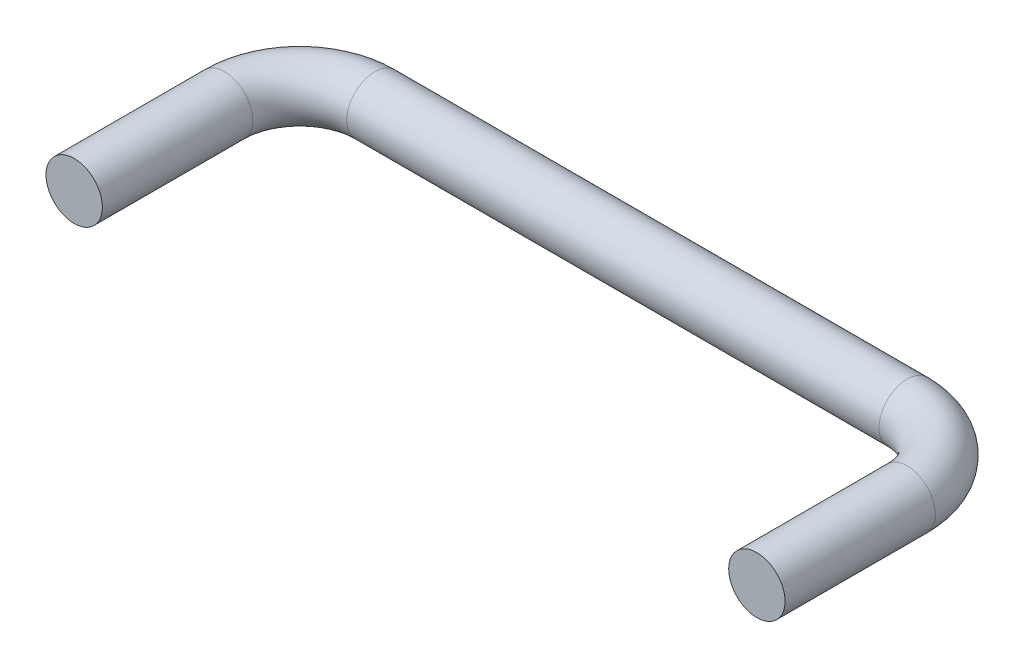
ISO-10303-21;
HEADER;
FILE_DESCRIPTION(('STEP AP214'),'2;1');
FILE_NAME('part.step','',(''),(''),'','','');
FILE_SCHEMA(('AUTOMOTIVE_DESIGN { 1 0 10303 214 1 1 1 1 }'));
ENDSEC;
DATA;
#1=APPLICATION_CONTEXT('core data for automotive mechanical design processes');
#2=APPLICATION_PROTOCOL_DEFINITION('international standard','automotive_design',2000,#1);
#3=PRODUCT_CONTEXT('',#1,'mechanical');
#4=PRODUCT('Part','Part','',(#3));
#5=PRODUCT_RELATED_PRODUCT_CATEGORY('part','',(#4));
#6=PRODUCT_DEFINITION_FORMATION('','',#4);
#7=PRODUCT_DEFINITION_CONTEXT('part definition',#1,'design');
#8=PRODUCT_DEFINITION('design','',#6,#7);
#9=PRODUCT_DEFINITION_SHAPE('','',#8);
#10=(LENGTH_UNIT() NAMED_UNIT(*) SI_UNIT(.MILLI.,.METRE.));
#11=(NAMED_UNIT(*) PLANE_ANGLE_UNIT() SI_UNIT($,.RADIAN.));
#12=(NAMED_UNIT(*) SI_UNIT($,.STERADIAN.) SOLID_ANGLE_UNIT());
#13=UNCERTAINTY_MEASURE_WITH_UNIT(LENGTH_MEASURE(1.E-05),#10,'distance_accuracy_value','');
#14=(GEOMETRIC_REPRESENTATION_CONTEXT(3) GLOBAL_UNCERTAINTY_ASSIGNED_CONTEXT((#13)) GLOBAL_UNIT_ASSIGNED_CONTEXT((#10,
#11,#12)) REPRESENTATION_CONTEXT('',''));
#15=CARTESIAN_POINT('',(0.,0.,0.));
#16=DIRECTION('',(0.,0.,1.));
#17=DIRECTION('',(1.,0.,0.));
#18=AXIS2_PLACEMENT_3D('',#15,#16,#17);
#19=CARTESIAN_POINT('',(0.,0.,0.));
#20=DIRECTION('',(0.,0.,1.));
#21=DIRECTION('',(1.,0.,0.));
#22=AXIS2_PLACEMENT_3D('',#19,#20,#21);
#23=PLANE('',#22);
#24=CARTESIAN_POINT('',(0.,0.,0.));
#25=DIRECTION('',(0.,0.,1.));
#26=DIRECTION('',(1.,0.,0.));
#27=AXIS2_PLACEMENT_3D('',#24,#25,#26);
#28=CIRCLE('',#27,3.75);
#29=CARTESIAN_POINT('',(3.75,0.,0.));
#30=VERTEX_POINT('',#29);
#31=EDGE_CURVE('E58',#30,#30,#28,.T.);
#32=ORIENTED_EDGE('',*,*,#31,.T.);
#33=EDGE_LOOP('',(#32));
#34=FACE_BOUND('',#33,.T.);
#35=ADVANCED_FACE('F36',(#34),#23,.T.);
#36=CARTESIAN_POINT('',(90.824,0.,0.));
#37=DIRECTION('',(0.,0.,-1.));
#38=DIRECTION('',(-1.,0.,0.));
#39=AXIS2_PLACEMENT_3D('',#36,#37,#38);
#40=PLANE('',#39);
#41=CARTESIAN_POINT('',(90.824,0.,0.));
#42=DIRECTION('',(0.,0.,-1.));
#43=DIRECTION('',(-1.,0.,0.));
#44=AXIS2_PLACEMENT_3D('',#41,#42,#43);
#45=CIRCLE('',#44,3.75);
#46=CARTESIAN_POINT('',(87.074,0.,0.));
#47=VERTEX_POINT('',#46);
#48=EDGE_CURVE('E10',#47,#47,#45,.T.);
#49=ORIENTED_EDGE('',*,*,#48,.F.);
#50=EDGE_LOOP('',(#49));
#51=FACE_BOUND('',#50,.T.);
#52=ADVANCED_FACE('F66',(#51),#40,.F.);
#53=CARTESIAN_POINT('',(0.,0.,0.));
#54=DIRECTION('',(0.,0.,-1.));
#55=DIRECTION('',(-1.,0.,0.));
#56=AXIS2_PLACEMENT_3D('',#53,#54,#55);
#57=CYLINDRICAL_SURFACE('',#56,3.75);
#58=CARTESIAN_POINT('',(0.,0.,-19.9999999999999));
#59=DIRECTION('',(0.,0.,1.));
#60=DIRECTION('',(1.,0.,0.));
#61=AXIS2_PLACEMENT_3D('',#58,#59,#60);
#62=CIRCLE('',#61,3.75);
#63=CARTESIAN_POINT('',(-3.75,0.,-19.9999999999999));
#64=VERTEX_POINT('',#63);
#65=EDGE_CURVE('E55',#64,#64,#62,.T.);
#66=ORIENTED_EDGE('',*,*,#65,.T.);
#67=EDGE_LOOP('',(#66));
#68=FACE_BOUND('',#67,.T.);
#69=ORIENTED_EDGE('',*,*,#31,.F.);
#70=EDGE_LOOP('',(#69));
#71=FACE_BOUND('',#70,.T.);
#72=ADVANCED_FACE('F63',(#68,#71),#57,.T.);
#73=CARTESIAN_POINT('',(10.,0.,-20.));
#74=DIRECTION('',(0.,-1.,0.));
#75=DIRECTION('',(0.,0.,-1.));
#76=AXIS2_PLACEMENT_3D('',#73,#74,#75);
#77=TOROIDAL_SURFACE('',#76,10.,3.75);
#78=CARTESIAN_POINT('',(10.0000000000001,0.,-30.));
#79=DIRECTION('',(-1.,0.,0.));
#80=DIRECTION('',(0.,0.,1.));
#81=AXIS2_PLACEMENT_3D('',#78,#79,#80);
#82=CIRCLE('',#81,3.75);
#83=CARTESIAN_POINT('',(10.0000000000001,0.,-33.75));
#84=VERTEX_POINT('',#83);
#85=EDGE_CURVE('E50',#84,#84,#82,.T.);
#86=CARTESIAN_POINT('',(10.,0.,-20.));
#87=DIRECTION('',(0.,-1.,0.));
#88=DIRECTION('',(0.,0.,-1.));
#89=AXIS2_PLACEMENT_3D('',#86,#87,#88);
#90=CIRCLE('',#89,13.75);
#91=EDGE_CURVE('',#64,#84,#90,.T.);
#92=ORIENTED_EDGE('',*,*,#65,.F.);
#93=ORIENTED_EDGE('',*,*,#85,.T.);
#94=ORIENTED_EDGE('',*,*,#91,.T.);
#95=ORIENTED_EDGE('',*,*,#91,.F.);
#96=EDGE_LOOP('',(#92,#94,#93,#95));
#97=FACE_BOUND('',#96,.T.);
#98=ADVANCED_FACE('F65',(#97),#77,.T.);
#99=CARTESIAN_POINT('',(10.0000000000001,0.,-30.));
#100=DIRECTION('',(1.,0.,0.));
#101=DIRECTION('',(0.,0.,-1.));
#102=AXIS2_PLACEMENT_3D('',#99,#100,#101);
#103=CYLINDRICAL_SURFACE('',#102,3.75);
#104=CARTESIAN_POINT('',(80.824,0.,-30.));
#105=DIRECTION('',(-1.,0.,0.));
#106=DIRECTION('',(0.,0.,1.));
#107=AXIS2_PLACEMENT_3D('',#104,#105,#106);
#108=CIRCLE('',#107,3.75);
#109=CARTESIAN_POINT('',(80.824,0.,-33.75));
#110=VERTEX_POINT('',#109);
#111=EDGE_CURVE('E46',#110,#110,#108,.T.);
#112=ORIENTED_EDGE('',*,*,#111,.T.);
#113=EDGE_LOOP('',(#112));
#114=FACE_BOUND('',#113,.T.);
#115=ORIENTED_EDGE('',*,*,#85,.F.);
#116=EDGE_LOOP('',(#115));
#117=FACE_BOUND('',#116,.T.);
#118=ADVANCED_FACE('F73',(#114,#117),#103,.T.);
#119=CARTESIAN_POINT('',(80.824,0.,-20.));
#120=DIRECTION('',(0.,-1.,0.));
#121=DIRECTION('',(0.,0.,-1.));
#122=AXIS2_PLACEMENT_3D('',#119,#120,#121);
#123=TOROIDAL_SURFACE('',#122,9.99999999999999,3.75);
#124=CARTESIAN_POINT('',(90.824,0.,-20.));
#125=DIRECTION('',(0.,0.,-1.));
#126=DIRECTION('',(-1.,0.,0.));
#127=AXIS2_PLACEMENT_3D('',#124,#125,#126);
#128=CIRCLE('',#127,3.75);
#129=CARTESIAN_POINT('',(94.574,0.,-20.));
#130=VERTEX_POINT('',#129);
#131=EDGE_CURVE('E42',#130,#130,#128,.T.);
#132=CARTESIAN_POINT('',(80.824,0.,-20.));
#133=DIRECTION('',(0.,-1.,0.));
#134=DIRECTION('',(0.,0.,-1.));
#135=AXIS2_PLACEMENT_3D('',#132,#133,#134);
#136=CIRCLE('',#135,13.75);
#137=EDGE_CURVE('',#110,#130,#136,.T.);
#138=ORIENTED_EDGE('',*,*,#111,.F.);
#139=ORIENTED_EDGE('',*,*,#131,.T.);
#140=ORIENTED_EDGE('',*,*,#137,.T.);
#141=ORIENTED_EDGE('',*,*,#137,.F.);
#142=EDGE_LOOP('',(#138,#140,#139,#141));
#143=FACE_BOUND('',#142,.T.);
#144=ADVANCED_FACE('F79',(#143),#123,.T.);
#145=CARTESIAN_POINT('',(90.824,0.,-20.));
#146=DIRECTION('',(0.,0.,1.));
#147=DIRECTION('',(1.,0.,0.));
#148=AXIS2_PLACEMENT_3D('',#145,#146,#147);
#149=CYLINDRICAL_SURFACE('',#148,3.75);
#150=ORIENTED_EDGE('',*,*,#48,.T.);
#151=EDGE_LOOP('',(#150));
#152=FACE_BOUND('',#151,.T.);
#153=ORIENTED_EDGE('',*,*,#131,.F.);
#154=EDGE_LOOP('',(#153));
#155=FACE_BOUND('',#154,.T.);
#156=ADVANCED_FACE('F77',(#152,#155),#149,.T.);
#157=CLOSED_SHELL('',(#35,#52,#72,#98,#118,#144,#156));
#158=MANIFOLD_SOLID_BREP('B2',#157);
#159=ADVANCED_BREP_SHAPE_REPRESENTATION('',(#18,#158),#14);
#160=SHAPE_DEFINITION_REPRESENTATION(#9,#159);
ENDSEC;
END-ISO-10303-21;
